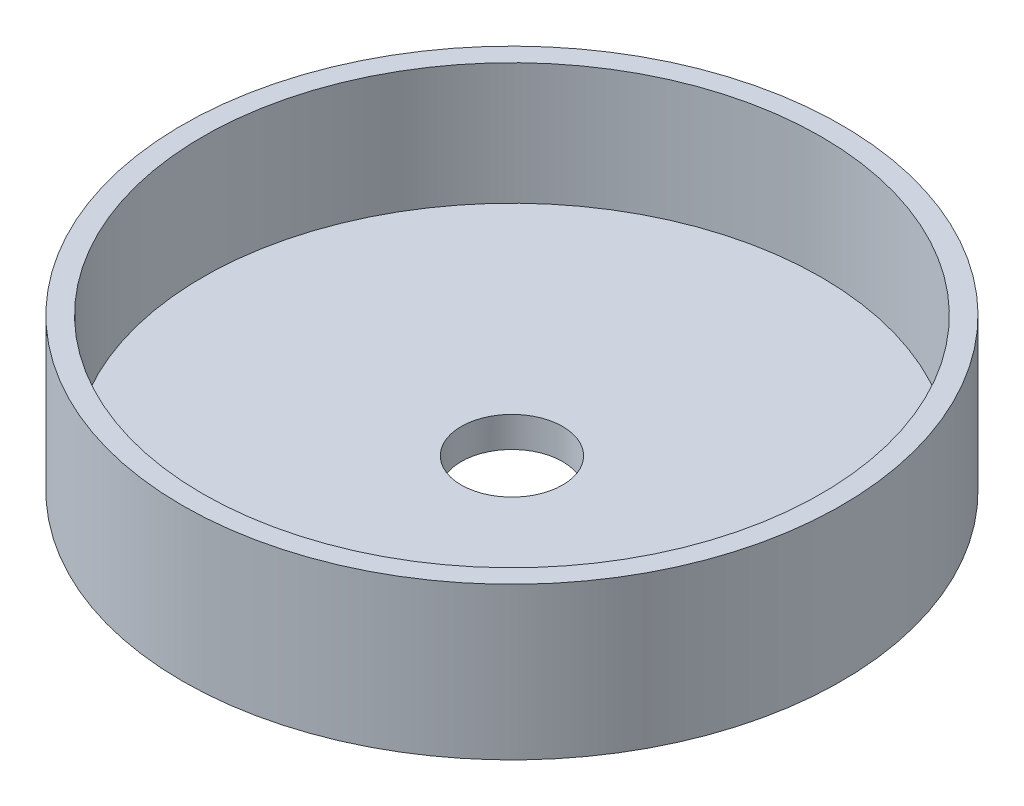
ISO-10303-21;
HEADER;
FILE_DESCRIPTION(('STEP AP214'),'2;1');
FILE_NAME('part.step','',(''),(''),'','','');
FILE_SCHEMA(('AUTOMOTIVE_DESIGN { 1 0 10303 214 1 1 1 1 }'));
ENDSEC;
DATA;
#1=APPLICATION_CONTEXT('core data for automotive mechanical design processes');
#2=APPLICATION_PROTOCOL_DEFINITION('international standard','automotive_design',2000,#1);
#3=PRODUCT_CONTEXT('',#1,'mechanical');
#4=PRODUCT('Part','Part','',(#3));
#5=PRODUCT_RELATED_PRODUCT_CATEGORY('part','',(#4));
#6=PRODUCT_DEFINITION_FORMATION('','',#4);
#7=PRODUCT_DEFINITION_CONTEXT('part definition',#1,'design');
#8=PRODUCT_DEFINITION('design','',#6,#7);
#9=PRODUCT_DEFINITION_SHAPE('','',#8);
#10=(LENGTH_UNIT() NAMED_UNIT(*) SI_UNIT(.MILLI.,.METRE.));
#11=(NAMED_UNIT(*) PLANE_ANGLE_UNIT() SI_UNIT($,.RADIAN.));
#12=(NAMED_UNIT(*) SI_UNIT($,.STERADIAN.) SOLID_ANGLE_UNIT());
#13=UNCERTAINTY_MEASURE_WITH_UNIT(LENGTH_MEASURE(1.E-05),#10,'distance_accuracy_value','');
#14=(GEOMETRIC_REPRESENTATION_CONTEXT(3) GLOBAL_UNCERTAINTY_ASSIGNED_CONTEXT((#13)) GLOBAL_UNIT_ASSIGNED_CONTEXT((#10,
#11,#12)) REPRESENTATION_CONTEXT('',''));
#15=CARTESIAN_POINT('',(0.,0.,0.));
#16=DIRECTION('',(0.,0.,1.));
#17=DIRECTION('',(1.,0.,0.));
#18=AXIS2_PLACEMENT_3D('',#15,#16,#17);
#19=CARTESIAN_POINT('',(0.,15.,0.));
#20=DIRECTION('',(0.,-1.,0.));
#21=DIRECTION('',(0.,0.,-1.));
#22=AXIS2_PLACEMENT_3D('',#19,#20,#21);
#23=CYLINDRICAL_SURFACE('',#22,32.5);
#24=CARTESIAN_POINT('',(0.,15.,0.));
#25=DIRECTION('',(0.,1.,0.));
#26=DIRECTION('',(0.,0.,1.));
#27=AXIS2_PLACEMENT_3D('',#24,#25,#26);
#28=CIRCLE('',#27,32.5);
#29=CARTESIAN_POINT('',(0.,15.,32.5));
#30=VERTEX_POINT('',#29);
#31=EDGE_CURVE('E10',#30,#30,#28,.T.);
#32=ORIENTED_EDGE('',*,*,#31,.F.);
#33=EDGE_LOOP('',(#32));
#34=FACE_BOUND('',#33,.T.);
#35=CARTESIAN_POINT('',(0.,0.,0.));
#36=DIRECTION('',(0.,1.,0.));
#37=DIRECTION('',(0.,0.,1.));
#38=AXIS2_PLACEMENT_3D('',#35,#36,#37);
#39=CIRCLE('',#38,32.5);
#40=CARTESIAN_POINT('',(0.,0.,32.5));
#41=VERTEX_POINT('',#40);
#42=EDGE_CURVE('E51',#41,#41,#39,.T.);
#43=ORIENTED_EDGE('',*,*,#42,.T.);
#44=EDGE_LOOP('',(#43));
#45=FACE_BOUND('',#44,.T.);
#46=ADVANCED_FACE('F43',(#34,#45),#23,.T.);
#47=CARTESIAN_POINT('',(0.,15.,0.));
#48=DIRECTION('',(0.,1.,0.));
#49=DIRECTION('',(0.,0.,1.));
#50=AXIS2_PLACEMENT_3D('',#47,#48,#49);
#51=PLANE('',#50);
#52=CARTESIAN_POINT('',(0.,15.,0.));
#53=DIRECTION('',(0.,1.,0.));
#54=DIRECTION('',(0.,0.,1.));
#55=AXIS2_PLACEMENT_3D('',#52,#53,#54);
#56=CIRCLE('',#55,30.5);
#57=CARTESIAN_POINT('',(0.,15.,30.5));
#58=VERTEX_POINT('',#57);
#59=EDGE_CURVE('E59',#58,#58,#56,.T.);
#60=ORIENTED_EDGE('',*,*,#59,.F.);
#61=EDGE_LOOP('',(#60));
#62=FACE_BOUND('',#61,.T.);
#63=ORIENTED_EDGE('',*,*,#31,.T.);
#64=EDGE_LOOP('',(#63));
#65=FACE_BOUND('',#64,.T.);
#66=ADVANCED_FACE('F90',(#62,#65),#51,.T.);
#67=CARTESIAN_POINT('',(0.,0.,0.));
#68=DIRECTION('',(0.,1.,0.));
#69=DIRECTION('',(0.,0.,1.));
#70=AXIS2_PLACEMENT_3D('',#67,#68,#69);
#71=PLANE('',#70);
#72=CARTESIAN_POINT('',(0.,0.,0.));
#73=DIRECTION('',(0.,-1.,0.));
#74=DIRECTION('',(0.,0.,-1.));
#75=AXIS2_PLACEMENT_3D('',#72,#73,#74);
#76=CIRCLE('',#75,5.);
#77=CARTESIAN_POINT('',(0.,0.,-5.));
#78=VERTEX_POINT('',#77);
#79=EDGE_CURVE('E66',#78,#78,#76,.T.);
#80=ORIENTED_EDGE('',*,*,#79,.F.);
#81=EDGE_LOOP('',(#80));
#82=FACE_BOUND('',#81,.T.);
#83=ORIENTED_EDGE('',*,*,#42,.F.);
#84=EDGE_LOOP('',(#83));
#85=FACE_BOUND('',#84,.T.);
#86=ADVANCED_FACE('F86',(#82,#85),#71,.F.);
#87=CARTESIAN_POINT('',(0.,3.,0.));
#88=DIRECTION('',(0.,1.,0.));
#89=DIRECTION('',(0.,0.,1.));
#90=AXIS2_PLACEMENT_3D('',#87,#88,#89);
#91=CYLINDRICAL_SURFACE('',#90,30.5);
#92=CARTESIAN_POINT('',(0.,3.,0.));
#93=DIRECTION('',(0.,1.,0.));
#94=DIRECTION('',(0.,0.,1.));
#95=AXIS2_PLACEMENT_3D('',#92,#93,#94);
#96=CIRCLE('',#95,30.5);
#97=CARTESIAN_POINT('',(0.,3.,30.5));
#98=VERTEX_POINT('',#97);
#99=EDGE_CURVE('E57',#98,#98,#96,.T.);
#100=ORIENTED_EDGE('',*,*,#99,.F.);
#101=EDGE_LOOP('',(#100));
#102=FACE_BOUND('',#101,.T.);
#103=ORIENTED_EDGE('',*,*,#59,.T.);
#104=EDGE_LOOP('',(#103));
#105=FACE_BOUND('',#104,.T.);
#106=ADVANCED_FACE('F80',(#102,#105),#91,.F.);
#107=CARTESIAN_POINT('',(0.,3.,0.));
#108=DIRECTION('',(0.,1.,0.));
#109=DIRECTION('',(0.,0.,1.));
#110=AXIS2_PLACEMENT_3D('',#107,#108,#109);
#111=PLANE('',#110);
#112=CARTESIAN_POINT('',(0.,3.,0.));
#113=DIRECTION('',(0.,1.,0.));
#114=DIRECTION('',(0.,0.,1.));
#115=AXIS2_PLACEMENT_3D('',#112,#113,#114);
#116=CIRCLE('',#115,5.);
#117=CARTESIAN_POINT('',(0.,3.,5.));
#118=VERTEX_POINT('',#117);
#119=EDGE_CURVE('E46',#118,#118,#116,.T.);
#120=ORIENTED_EDGE('',*,*,#119,.F.);
#121=EDGE_LOOP('',(#120));
#122=FACE_BOUND('',#121,.T.);
#123=ORIENTED_EDGE('',*,*,#99,.T.);
#124=EDGE_LOOP('',(#123));
#125=FACE_BOUND('',#124,.T.);
#126=ADVANCED_FACE('F77',(#122,#125),#111,.T.);
#127=CARTESIAN_POINT('',(0.,12.,0.));
#128=DIRECTION('',(0.,-1.,0.));
#129=DIRECTION('',(0.,0.,-1.));
#130=AXIS2_PLACEMENT_3D('',#127,#128,#129);
#131=CYLINDRICAL_SURFACE('',#130,5.);
#132=ORIENTED_EDGE('',*,*,#119,.T.);
#133=EDGE_LOOP('',(#132));
#134=FACE_BOUND('',#133,.T.);
#135=ORIENTED_EDGE('',*,*,#79,.T.);
#136=EDGE_LOOP('',(#135));
#137=FACE_BOUND('',#136,.T.);
#138=ADVANCED_FACE('F75',(#134,#137),#131,.F.);
#139=CLOSED_SHELL('',(#46,#66,#86,#106,#126,#138));
#140=MANIFOLD_SOLID_BREP('B2',#139);
#141=ADVANCED_BREP_SHAPE_REPRESENTATION('',(#18,#140),#14);
#142=SHAPE_DEFINITION_REPRESENTATION(#9,#141);
ENDSEC;
END-ISO-10303-21;
